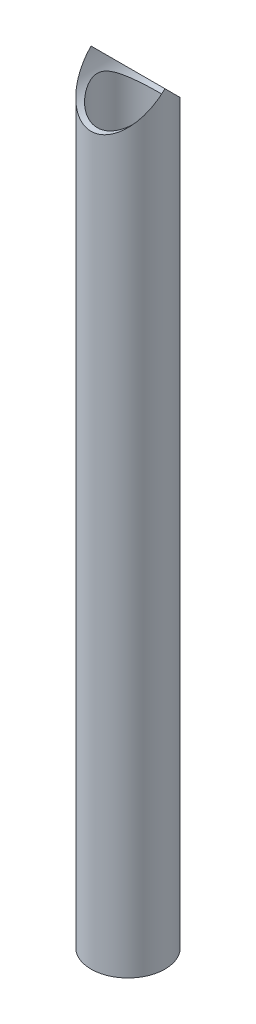
ISO-10303-21;
HEADER;
FILE_DESCRIPTION(('STEP AP214'),'2;1');
FILE_NAME('part.step','',(''),(''),'','','');
FILE_SCHEMA(('AUTOMOTIVE_DESIGN { 1 0 10303 214 1 1 1 1 }'));
ENDSEC;
DATA;
#1=APPLICATION_CONTEXT('core data for automotive mechanical design processes');
#2=APPLICATION_PROTOCOL_DEFINITION('international standard','automotive_design',2000,#1);
#3=PRODUCT_CONTEXT('',#1,'mechanical');
#4=PRODUCT('Part','Part','',(#3));
#5=PRODUCT_RELATED_PRODUCT_CATEGORY('part','',(#4));
#6=PRODUCT_DEFINITION_FORMATION('','',#4);
#7=PRODUCT_DEFINITION_CONTEXT('part definition',#1,'design');
#8=PRODUCT_DEFINITION('design','',#6,#7);
#9=PRODUCT_DEFINITION_SHAPE('','',#8);
#10=(LENGTH_UNIT() NAMED_UNIT(*) SI_UNIT(.MILLI.,.METRE.));
#11=(NAMED_UNIT(*) PLANE_ANGLE_UNIT() SI_UNIT($,.RADIAN.));
#12=(NAMED_UNIT(*) SI_UNIT($,.STERADIAN.) SOLID_ANGLE_UNIT());
#13=UNCERTAINTY_MEASURE_WITH_UNIT(LENGTH_MEASURE(1.E-05),#10,'distance_accuracy_value','');
#14=(GEOMETRIC_REPRESENTATION_CONTEXT(3) GLOBAL_UNCERTAINTY_ASSIGNED_CONTEXT((#13)) GLOBAL_UNIT_ASSIGNED_CONTEXT((#10,
#11,#12)) REPRESENTATION_CONTEXT('',''));
#15=CARTESIAN_POINT('',(0.,0.,0.));
#16=DIRECTION('',(0.,0.,1.));
#17=DIRECTION('',(1.,0.,0.));
#18=AXIS2_PLACEMENT_3D('',#15,#16,#17);
#19=CARTESIAN_POINT('',(0.,434.975,0.));
#20=DIRECTION('',(0.,-1.,0.));
#21=DIRECTION('',(0.,0.,-1.));
#22=AXIS2_PLACEMENT_3D('',#19,#20,#21);
#23=CYLINDRICAL_SURFACE('',#22,21.082);
#24=CARTESIAN_POINT('',(0.,0.,0.));
#25=DIRECTION('',(0.,1.,0.));
#26=DIRECTION('',(0.,0.,1.));
#27=AXIS2_PLACEMENT_3D('',#24,#25,#26);
#28=CIRCLE('',#27,21.082);
#29=CARTESIAN_POINT('',(0.,0.,21.082));
#30=VERTEX_POINT('',#29);
#31=EDGE_CURVE('E11',#30,#30,#28,.T.);
#32=ORIENTED_EDGE('',*,*,#31,.T.);
#33=EDGE_LOOP('',(#32));
#34=FACE_BOUND('',#33,.T.);
#35=CARTESIAN_POINT('',(0.,434.975,0.));
#36=DIRECTION('',(0.,-0.707106781186548,0.707106781186547));
#37=DIRECTION('',(0.,-0.707106781186548,-0.707106781186547));
#38=AXIS2_PLACEMENT_3D('',#35,#36,#37);
#39=ELLIPSE('',#38,29.8144503219496,21.082);
#40=CARTESIAN_POINT('',(-21.082,434.975,0.));
#41=VERTEX_POINT('',#40);
#42=CARTESIAN_POINT('',(21.082,434.975,0.));
#43=VERTEX_POINT('',#42);
#44=EDGE_CURVE('E52',#41,#43,#39,.T.);
#45=ORIENTED_EDGE('',*,*,#44,.T.);
#46=CARTESIAN_POINT('',(0.,434.975,0.));
#47=DIRECTION('',(0.,-0.707106781186548,-0.707106781186547));
#48=DIRECTION('',(0.,-0.707106781186548,0.707106781186547));
#49=AXIS2_PLACEMENT_3D('',#46,#47,#48);
#50=ELLIPSE('',#49,29.8144503219496,21.082);
#51=EDGE_CURVE('E55',#43,#41,#50,.T.);
#52=ORIENTED_EDGE('',*,*,#51,.T.);
#53=EDGE_LOOP('',(#45,#52));
#54=FACE_BOUND('',#53,.T.);
#55=ADVANCED_FACE('F34',(#34,#54),#23,.T.);
#56=CARTESIAN_POINT('',(0.,0.,0.));
#57=DIRECTION('',(0.,1.,0.));
#58=DIRECTION('',(0.,0.,1.));
#59=AXIS2_PLACEMENT_3D('',#56,#57,#58);
#60=PLANE('',#59);
#61=ORIENTED_EDGE('',*,*,#31,.F.);
#62=EDGE_LOOP('',(#61));
#63=FACE_BOUND('',#62,.T.);
#64=CARTESIAN_POINT('',(0.,0.,0.));
#65=DIRECTION('',(0.,1.,0.));
#66=DIRECTION('',(0.,0.,1.));
#67=AXIS2_PLACEMENT_3D('',#64,#65,#66);
#68=CIRCLE('',#67,17.526);
#69=CARTESIAN_POINT('',(0.,0.,17.526));
#70=VERTEX_POINT('',#69);
#71=EDGE_CURVE('E46',#70,#70,#68,.T.);
#72=ORIENTED_EDGE('',*,*,#71,.T.);
#73=EDGE_LOOP('',(#72));
#74=FACE_BOUND('',#73,.T.);
#75=ADVANCED_FACE('F64',(#63,#74),#60,.F.);
#76=CARTESIAN_POINT('',(0.,434.975,0.));
#77=DIRECTION('',(0.,-1.,0.));
#78=DIRECTION('',(0.,0.,-1.));
#79=AXIS2_PLACEMENT_3D('',#76,#77,#78);
#80=CYLINDRICAL_SURFACE('',#79,17.526);
#81=CARTESIAN_POINT('',(0.,413.893,-17.526));
#82=CARTESIAN_POINT('',(0.416555730228904,413.893003100232,-17.525996813955));
#83=CARTESIAN_POINT('',(0.833163012071538,413.905373313981,-17.5111221446535));
#84=CARTESIAN_POINT('',(1.66285085098588,413.954570724751,-17.4518957288154));
#85=CARTESIAN_POINT('',(2.07593080746839,413.991402005793,-17.4075390599622));
#86=CARTESIAN_POINT('',(2.89546158233792,414.088702439066,-17.2901260170745));
#87=CARTESIAN_POINT('',(3.30190733638104,414.149188843433,-17.2170486963236));
#88=CARTESIAN_POINT('',(4.10484124386305,414.292462942405,-17.0434647188049));
#89=CARTESIAN_POINT('',(4.50132958743919,414.375250210819,-16.9429585862272));
#90=CARTESIAN_POINT('',(5.27944797465432,414.560858337995,-16.7167963170662));
#91=CARTESIAN_POINT('',(5.66115402240747,414.663553655403,-16.5912976561353));
#92=CARTESIAN_POINT('',(6.41026860382346,414.88739125938,-16.3165047587702));
#93=CARTESIAN_POINT('',(6.77767737045172,415.008533245215,-16.1672109102661));
#94=CARTESIAN_POINT('',(7.49674702968466,415.267247114563,-15.8465909890381));
#95=CARTESIAN_POINT('',(7.84840695050786,415.404820010029,-15.6752635592522));
#96=CARTESIAN_POINT('',(8.53495429518088,415.694332247339,-15.3122852034019));
#97=CARTESIAN_POINT('',(8.86983814178559,415.846274633481,-15.1206299696701));
#98=CARTESIAN_POINT('',(9.64160099861962,416.220390089599,-14.6449374869007));
#99=CARTESIAN_POINT('',(10.0709113512938,416.447902769384,-14.3527749107547));
#100=CARTESIAN_POINT('',(10.8958978241819,416.920738465582,-13.7370028939555));
#101=CARTESIAN_POINT('',(11.2915625079794,417.166067485787,-13.4133828401386));
#102=CARTESIAN_POINT('',(12.0497757762481,417.670048875036,-12.7366579401323));
#103=CARTESIAN_POINT('',(12.4122381349312,417.92873335067,-12.3834806406871));
#104=CARTESIAN_POINT('',(13.102805813699,418.453641944567,-11.6503545982694));
#105=CARTESIAN_POINT('',(13.4309154311957,418.719865114459,-11.2704092138659));
#106=CARTESIAN_POINT('',(14.0584742968281,419.259266862729,-10.4776077506457));
#107=CARTESIAN_POINT('',(14.3572918160694,419.532483749344,-10.0642778803075));
#108=CARTESIAN_POINT('',(14.9191165849368,420.074563078632,-9.21095532717231));
#109=CARTESIAN_POINT('',(15.1821118547605,420.343424038226,-8.77095379548324));
#110=CARTESIAN_POINT('',(15.6706637077535,420.867941041438,-7.86481925902692));
#111=CARTESIAN_POINT('',(15.8963093356672,421.123627460908,-7.39875205622171));
#112=CARTESIAN_POINT('',(16.3089147666568,421.611919817722,-6.43838077354221));
#113=CARTESIAN_POINT('',(16.4959076106971,421.844545378546,-5.94410127510899));
#114=CARTESIAN_POINT('',(16.7529770224336,422.176142415188,-5.15602712210236));
#115=CARTESIAN_POINT('',(16.837735543251,422.288056838252,-4.87241120041701));
#116=CARTESIAN_POINT('',(16.9938564773723,422.497955453925,-4.29634473218567));
#117=CARTESIAN_POINT('',(17.0652171570416,422.59593784338,-4.00389304799846));
#118=CARTESIAN_POINT('',(17.1934754104678,422.774703347219,-3.41127303424146));
#119=CARTESIAN_POINT('',(17.2504011700851,422.855519928926,-3.11112102298287));
#120=CARTESIAN_POINT('',(17.3489622258268,422.997033138788,-2.503748224318));
#121=CARTESIAN_POINT('',(17.3906055672393,423.057740351692,-2.19653124698384));
#122=CARTESIAN_POINT('',(17.4581424184477,423.156892338332,-1.57275012439623));
#123=CARTESIAN_POINT('',(17.4838316609619,423.195048088988,-1.25611705495766));
#124=CARTESIAN_POINT('',(17.517930419636,423.245814384314,-0.619877416859233));
#125=CARTESIAN_POINT('',(17.526341492641,423.258427230519,-0.30027111870848));
#126=CARTESIAN_POINT('',(17.5256372212721,423.257373738161,0.338900631657947));
#127=CARTESIAN_POINT('',(17.5165207489109,423.243705708289,0.658466079921124));
#128=CARTESIAN_POINT('',(17.4810304342677,423.190888550502,1.2945099035854));
#129=CARTESIAN_POINT('',(17.454654452937,423.151736264212,1.61098789140884));
#130=CARTESIAN_POINT('',(17.3822895125155,423.045574257895,2.26597180787558));
#131=CARTESIAN_POINT('',(17.3347748801548,422.976410695607,2.60395639596629));
#132=CARTESIAN_POINT('',(17.2213863424108,422.81423050578,3.27094152568145));
#133=CARTESIAN_POINT('',(17.1555094618906,422.721210013026,3.59994060193883));
#134=CARTESIAN_POINT('',(17.0065131076897,422.515248964524,4.24855727344999));
#135=CARTESIAN_POINT('',(16.9233482836622,422.40225613574,4.56814761827544));
#136=CARTESIAN_POINT('',(16.7410384013215,422.160503660727,5.19667563423267));
#137=CARTESIAN_POINT('',(16.6418871073676,422.031737866865,5.50560909125264));
#138=CARTESIAN_POINT('',(16.3663636741079,421.683397015409,6.28987340285502));
#139=CARTESIAN_POINT('',(16.1786783054546,421.454655644521,6.75718011774371));
#140=CARTESIAN_POINT('',(15.7683263145676,420.978226191773,7.66612047395259));
#141=CARTESIAN_POINT('',(15.5456394491178,420.730527188512,8.10773905469753));
#142=CARTESIAN_POINT('',(15.0664754392744,420.224622952079,8.96683638051189));
#143=CARTESIAN_POINT('',(14.8099532398125,419.96640403316,9.38428185098053));
#144=CARTESIAN_POINT('',(14.2641231324516,419.446716965766,10.1948087082538));
#145=CARTESIAN_POINT('',(13.9748217341554,419.185249471574,10.5878949086503));
#146=CARTESIAN_POINT('',(13.348195218157,418.651574879337,11.368790869149));
#147=CARTESIAN_POINT('',(13.0091843032674,418.379490901127,11.7553355433847));
#148=CARTESIAN_POINT('',(12.2951909614096,417.843791373633,12.5002060187878));
#149=CARTESIAN_POINT('',(11.9202031744408,417.580177094039,12.8585276006225));
#150=CARTESIAN_POINT('',(11.1350258886843,417.067424827839,13.5441070863272));
#151=CARTESIAN_POINT('',(10.7249051788906,416.818260084927,13.8714231651621));
#152=CARTESIAN_POINT('',(10.0834868401277,416.4592205029,14.3371461507588));
#153=CARTESIAN_POINT('',(9.8653306424743,416.342002726259,14.4881649831134));
#154=CARTESIAN_POINT('',(9.42027707168284,416.113087871324,14.7814103315513));
#155=CARTESIAN_POINT('',(9.19337757252927,416.001392151037,14.9236346869964));
#156=CARTESIAN_POINT('',(8.61498224084045,415.729743112914,15.2678084182525));
#157=CARTESIAN_POINT('',(8.25811349099296,415.573709068209,15.4639027842677));
#158=CARTESIAN_POINT('',(7.52616004996059,415.278214191443,15.8330525436508));
#159=CARTESIAN_POINT('',(7.15107971509297,415.138749423159,16.0061134100713));
#160=CARTESIAN_POINT('',(6.38410638575885,414.878787175912,16.3271734823368));
#161=CARTESIAN_POINT('',(5.99221937735623,414.75828301395,16.4751815198914));
#162=CARTESIAN_POINT('',(5.19343454244431,414.538500109816,16.7441479493523));
#163=CARTESIAN_POINT('',(4.78653646212599,414.439221726726,16.8651058836479));
#164=CARTESIAN_POINT('',(3.95712937963008,414.263339403541,17.0788335101841));
#165=CARTESIAN_POINT('',(3.53452536865489,414.186913185674,17.1713824047497));
#166=CARTESIAN_POINT('',(2.67986601870688,414.05955895774,17.325342710614));
#167=CARTESIAN_POINT('',(2.24781066246181,414.008630994275,17.3867540650041));
#168=CARTESIAN_POINT('',(1.37821649825806,413.933574216148,17.4771905064637));
#169=CARTESIAN_POINT('',(0.940680508218325,413.909432158585,17.5062315973617));
#170=CARTESIAN_POINT('',(0.0640313485043055,413.888540012414,17.5313661812511));
#171=CARTESIAN_POINT('',(-0.375081652379848,413.891787074792,17.5274631010918));
#172=CARTESIAN_POINT('',(-1.19930498558239,413.923585633984,17.4891990815668));
#173=CARTESIAN_POINT('',(-1.58470875998572,413.949124675364,17.4584640327402));
#174=CARTESIAN_POINT('',(-2.35069997583225,414.020934232639,17.3719144045829));
#175=CARTESIAN_POINT('',(-2.73128786604045,414.067202802018,17.3161021800126));
#176=CARTESIAN_POINT('',(-3.48513791526225,414.17957254399,17.1802563891461));
#177=CARTESIAN_POINT('',(-3.85839963308745,414.245674907109,17.1002213688688));
#178=CARTESIAN_POINT('',(-4.59536738648548,414.39649630486,16.9170761014037));
#179=CARTESIAN_POINT('',(-4.95907294143571,414.481216273857,16.813964696073));
#180=CARTESIAN_POINT('',(-5.68108005964253,414.669395504432,16.5840874699882));
#181=CARTESIAN_POINT('',(-6.03918783157443,414.773145992016,16.4569529541794));
#182=CARTESIAN_POINT('',(-6.74203119401673,414.996717917882,16.1817226350541));
#183=CARTESIAN_POINT('',(-7.08676703852214,415.116539050714,16.033627230131));
#184=CARTESIAN_POINT('',(-7.76177112537948,415.370518706947,15.7179651464271));
#185=CARTESIAN_POINT('',(-8.09203732526565,415.504679245294,15.5503957309038));
#186=CARTESIAN_POINT('',(-8.7372708220868,415.785557650088,15.1972398091077));
#187=CARTESIAN_POINT('',(-9.05223503545282,415.932278031205,15.0116496938153));
#188=CARTESIAN_POINT('',(-9.80464712063615,416.305062920572,14.5364034891831));
#189=CARTESIAN_POINT('',(-10.2333578451482,416.537096995919,14.2375288779349));
#190=CARTESIAN_POINT('',(-11.0565036944503,417.018608234905,13.6081978996813));
#191=CARTESIAN_POINT('',(-11.4509254939542,417.268092112484,13.2777293585403));
#192=CARTESIAN_POINT('',(-12.2062013475731,417.779998955069,12.5869774042747));
#193=CARTESIAN_POINT('',(-12.5669530526874,418.042457884647,12.2266089972621));
#194=CARTESIAN_POINT('',(-13.253470559835,418.574246141296,11.4788424530419));
#195=CARTESIAN_POINT('',(-13.5792413783913,418.84357447637,11.091448204724));
#196=CARTESIAN_POINT('',(-14.2012900820747,419.388212798302,10.2834169092844));
#197=CARTESIAN_POINT('',(-14.4969406813881,419.663544003942,9.86231131131111));
#198=CARTESIAN_POINT('',(-15.0517275612925,420.208572074852,8.99289776114401));
#199=CARTESIAN_POINT('',(-15.3108500388738,420.478266777624,8.54457961710636));
#200=CARTESIAN_POINT('',(-15.7906628138658,421.002472682617,7.62139093429992));
#201=CARTESIAN_POINT('',(-16.0114631279653,421.257025922646,7.14660175430666));
#202=CARTESIAN_POINT('',(-16.4132437140876,421.740399383237,6.16809279152982));
#203=CARTESIAN_POINT('',(-16.5942626782093,421.969244501134,5.66440172614313));
#204=CARTESIAN_POINT('',(-16.8388425611418,422.289416365567,4.86810478458101));
#205=CARTESIAN_POINT('',(-16.9179225696371,422.39526918611,4.58604260557918));
#206=CARTESIAN_POINT('',(-17.062806654192,422.592500596365,4.01353560636167));
#207=CARTESIAN_POINT('',(-17.1286126119829,422.68388123726,3.72309198098295));
#208=CARTESIAN_POINT('',(-17.2459247048064,422.849032938295,3.13503376582413));
#209=CARTESIAN_POINT('',(-17.2974603903694,422.922840343537,2.8374354029625));
#210=CARTESIAN_POINT('',(-17.3854671554673,423.05014080646,2.2357530301374));
#211=CARTESIAN_POINT('',(-17.4219421463683,423.103639138256,1.93167072569975));
#212=CARTESIAN_POINT('',(-17.4793343349964,423.188300986908,1.31542257105264));
#213=CARTESIAN_POINT('',(-17.5000736934338,423.219209056324,1.00320440672019));
#214=CARTESIAN_POINT('',(-17.524756770186,423.256035417953,0.376634351053878));
#215=CARTESIAN_POINT('',(-17.5287017145648,423.261955534394,0.0622826171579146));
#216=CARTESIAN_POINT('',(-17.519682115217,423.248469236601,-0.565765427557085));
#217=CARTESIAN_POINT('',(-17.5067100959756,423.229051625762,-0.879461387224702));
#218=CARTESIAN_POINT('',(-17.4642111799082,423.165958218613,-1.5032616624968));
#219=CARTESIAN_POINT('',(-17.4346819572414,423.122279014212,-1.81336546725247));
#220=CARTESIAN_POINT('',(-17.3549094765865,423.00572913328,-2.467833731127));
#221=CARTESIAN_POINT('',(-17.302463431889,422.929789424602,-2.81137909094877));
#222=CARTESIAN_POINT('',(-17.1787080018257,422.753943607651,-3.48874159064588));
#223=CARTESIAN_POINT('',(-17.1073947213456,422.654032550923,-3.8225567059095));
#224=CARTESIAN_POINT('',(-16.947078987979,422.434436596836,-4.48018532937911));
#225=CARTESIAN_POINT('',(-16.8580308311813,422.31470074705,-4.8039704451903));
#226=CARTESIAN_POINT('',(-16.6635408359203,422.059781095877,-5.44039078400232));
#227=CARTESIAN_POINT('',(-16.5580926547886,421.924591323107,-5.75302163536543));
#228=CARTESIAN_POINT('',(-16.2655608949425,421.559928142386,-6.54686642927635));
#229=CARTESIAN_POINT('',(-16.0668060807317,421.321561783285,-7.01971862379026));
#230=CARTESIAN_POINT('',(-15.6331071713109,420.827028251224,-7.93883090279243));
#231=CARTESIAN_POINT('',(-15.3981425218364,420.570851013657,-8.38507568297593));
#232=CARTESIAN_POINT('',(-14.8931005076266,420.049241177891,-9.25247800104896));
#233=CARTESIAN_POINT('',(-14.6229771058187,419.783796784682,-9.67360157184693));
#234=CARTESIAN_POINT('',(-14.0485414814654,419.25104644847,-10.4903942108924));
#235=CARTESIAN_POINT('',(-13.7442360709218,418.983740886297,-10.8860683262347));
#236=CARTESIAN_POINT('',(-13.0872302237909,418.441258627962,-11.6686564771624));
#237=CARTESIAN_POINT('',(-12.7329783860628,418.166261314537,-12.054396281746));
#238=CARTESIAN_POINT('',(-11.9872775461265,417.626574829164,-12.7961902436962));
#239=CARTESIAN_POINT('',(-11.5958224834142,417.36188734665,-13.1522395466039));
#240=CARTESIAN_POINT('',(-10.776623787392,416.849106716602,-13.8313916713883));
#241=CARTESIAN_POINT('',(-10.3489546907981,416.600981277596,-14.1545592898452));
#242=CARTESIAN_POINT('',(-9.68055384180479,416.245308671317,-14.6123392874479));
#243=CARTESIAN_POINT('',(-9.45330032462176,416.129516967441,-14.7604208100895));
#244=CARTESIAN_POINT('',(-8.98986303225829,415.904093154438,-15.0471693205303));
#245=CARTESIAN_POINT('',(-8.7536771354263,415.79446252428,-15.1858340494738));
#246=CARTESIAN_POINT('',(-8.16388969440335,415.534132456114,-15.5135810654738));
#247=CARTESIAN_POINT('',(-7.80547285234026,415.387269615212,-15.6971201066552));
#248=CARTESIAN_POINT('',(-7.07152507053722,415.110508282389,-16.0411475968501));
#249=CARTESIAN_POINT('',(-6.69599823719479,414.980605748624,-16.2016415386992));
#250=CARTESIAN_POINT('',(-5.92969186792639,414.740115788701,-16.4975121757086));
#251=CARTESIAN_POINT('',(-5.53893068115681,414.629505954141,-16.6329180221441));
#252=CARTESIAN_POINT('',(-4.74382214338574,414.429567296928,-16.8768969338329));
#253=CARTESIAN_POINT('',(-4.33947723349803,414.340234673672,-16.9854747913174));
#254=CARTESIAN_POINT('',(-3.61139042732532,414.202094180231,-17.1529959877094));
#255=CARTESIAN_POINT('',(-3.28980936544959,414.148691530083,-17.2176086822695));
#256=CARTESIAN_POINT('',(-2.64139463379433,414.056563709527,-17.3289327236608));
#257=CARTESIAN_POINT('',(-2.31455996491102,414.017841366206,-17.3756406224611));
#258=CARTESIAN_POINT('',(-1.65730095597501,413.955650717763,-17.4505998410856));
#259=CARTESIAN_POINT('',(-1.32687627951214,413.932183854947,-17.4788494157967));
#260=CARTESIAN_POINT('',(-0.664311705528072,413.900859151471,-17.5165484873698));
#261=CARTESIAN_POINT('',(-0.332172243283645,413.892997527795,-17.5260025406341));
#262=CARTESIAN_POINT('',(0.,413.893,-17.526));
#263=B_SPLINE_CURVE_WITH_KNOTS('',3,(#81,#82,#83,#84,#85,#86,#87,#88,#89,#90,#91,#92,#93,#94,
#95,#96,#97,#98,#99,#100,#101,#102,#103,#104,#105,#106,#107,#108,#109,#110,#111,#112,#113,#114,
#115,#116,#117,#118,#119,#120,#121,#122,#123,#124,#125,#126,#127,#128,#129,#130,#131,#132,#133,
#134,#135,#136,#137,#138,#139,#140,#141,#142,#143,#144,#145,#146,#147,#148,#149,#150,#151,#152,
#153,#154,#155,#156,#157,#158,#159,#160,#161,#162,#163,#164,#165,#166,#167,#168,#169,#170,#171,
#172,#173,#174,#175,#176,#177,#178,#179,#180,#181,#182,#183,#184,#185,#186,#187,#188,#189,#190,
#191,#192,#193,#194,#195,#196,#197,#198,#199,#200,#201,#202,#203,#204,#205,#206,#207,#208,#209,
#210,#211,#212,#213,#214,#215,#216,#217,#218,#219,#220,#221,#222,#223,#224,#225,#226,#227,#228,
#229,#230,#231,#232,#233,#234,#235,#236,#237,#238,#239,#240,#241,#242,#243,#244,#245,#246,#247,
#248,#249,#250,#251,#252,#253,#254,#255,#256,#257,#258,#259,#260,#261,#262),.UNSPECIFIED.,.T.,
.F.,(4,2,2,2,2,2,2,2,2,2,2,2,2,2,2,2,2,2,2,2,2,2,2,2,2,2,2,2,2,2,2,2,2,2,2,2,2,2,2,2,2,2,2,2,2,
2,2,2,2,2,2,2,2,2,2,2,2,2,2,2,2,2,2,2,2,2,2,2,2,2,2,2,2,2,2,2,2,2,2,2,2,2,2,2,2,2,2,2,2,2,4),
(0.,1.24931215514067,2.49883294793601,3.74926674484586,4.99967664647633,6.24244384055413,
7.48519077601584,8.72801428973388,9.9711016985285,11.6694991969452,13.3684717049052,
15.0717382323204,16.7747914316099,18.508900041403,20.2435871614538,21.9740771383339,
23.7030816933734,24.6518793950268,25.6007997833557,26.5478527733324,27.4944064783684,
28.4528421356183,29.4111914294722,30.3696024000782,31.3281321733839,32.3712679495731,
33.4145728378165,34.4606499010714,35.5071359859366,37.1638893836604,38.8216045193316,
40.4815497807695,42.1411659704712,43.8844508919194,45.6279959405213,47.3682019789461,
48.2381335315761,49.1082779678088,50.4151915777868,51.7217940919451,53.0279350344375,
54.3340980714494,55.6501696985348,56.9662437309291,58.2816668085292,59.5969530576399,
60.7579780281908,61.9188940006416,63.0798796712698,64.240923621771,65.4214962902464,
66.6020465231705,67.7827628635306,68.9637161565106,70.6766447530631,72.3902360758568,
74.1088773225333,75.8272717729951,77.5762157648221,79.3258188748361,81.0703129492533,
82.8131027115062,83.7469352207904,84.6806352566831,85.6123870984828,86.5438968054862,
87.4857834704328,88.4276013724583,89.3698355997799,90.3122022187916,91.3777285366849,
92.4434750028668,93.5120043575646,94.5809479956882,96.2751844313666,97.9703861554526,
99.6678303471317,101.364936859805,103.137598327809,104.910549063673,106.679935458133,
107.564410898222,108.449097758104,109.733689326203,111.01797419982,112.300757301213,
113.58331109564,114.579500372221,115.575881394522,116.57235660447,117.568590219854),.UNSPECIFIED.);
#264=CARTESIAN_POINT('',(0.,413.893,-17.526));
#265=VERTEX_POINT('',#264);
#266=EDGE_CURVE('E37',#265,#265,#263,.T.);
#267=ORIENTED_EDGE('',*,*,#266,.F.);
#268=EDGE_LOOP('',(#267));
#269=FACE_BOUND('',#268,.T.);
#270=ORIENTED_EDGE('',*,*,#71,.F.);
#271=EDGE_LOOP('',(#270));
#272=FACE_BOUND('',#271,.T.);
#273=ADVANCED_FACE('F66',(#269,#272),#80,.F.);
#274=CARTESIAN_POINT('',(0.,434.975,-21.082));
#275=DIRECTION('',(0.,0.,1.));
#276=DIRECTION('',(1.,0.,0.));
#277=AXIS2_PLACEMENT_3D('',#274,#275,#276);
#278=CYLINDRICAL_SURFACE('',#277,21.082);
#279=ORIENTED_EDGE('',*,*,#266,.T.);
#280=EDGE_LOOP('',(#279));
#281=FACE_BOUND('',#280,.T.);
#282=ORIENTED_EDGE('',*,*,#51,.F.);
#283=ORIENTED_EDGE('',*,*,#44,.F.);
#284=EDGE_LOOP('',(#282,#283));
#285=FACE_BOUND('',#284,.T.);
#286=ADVANCED_FACE('F57',(#281,#285),#278,.F.);
#287=CLOSED_SHELL('',(#55,#75,#273,#286));
#288=MANIFOLD_SOLID_BREP('B2',#287);
#289=ADVANCED_BREP_SHAPE_REPRESENTATION('',(#18,#288),#14);
#290=SHAPE_DEFINITION_REPRESENTATION(#9,#289);
ENDSEC;
END-ISO-10303-21;
